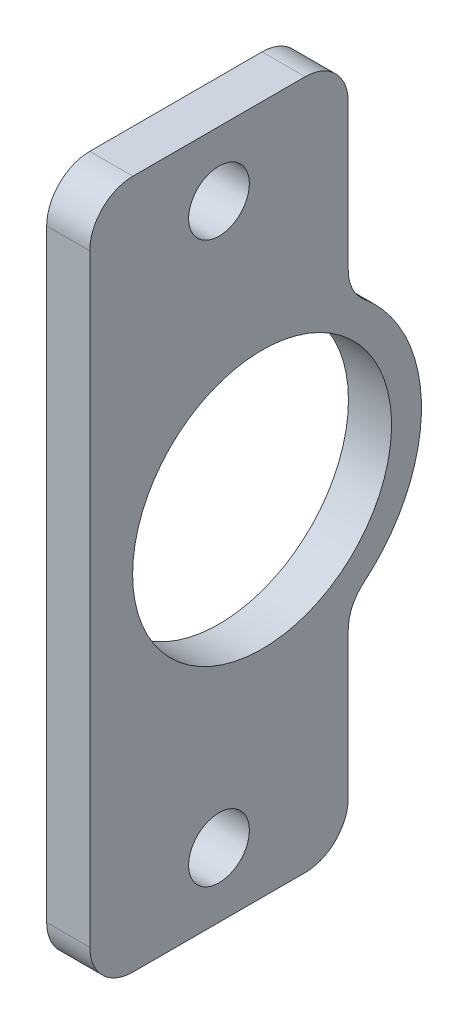
ISO-10303-21;
HEADER;
FILE_DESCRIPTION(('STEP AP214'),'2;1');
FILE_NAME('part.step','',(''),(''),'','','');
FILE_SCHEMA(('AUTOMOTIVE_DESIGN { 1 0 10303 214 1 1 1 1 }'));
ENDSEC;
DATA;
#1=APPLICATION_CONTEXT('core data for automotive mechanical design processes');
#2=APPLICATION_PROTOCOL_DEFINITION('international standard','automotive_design',2000,#1);
#3=PRODUCT_CONTEXT('',#1,'mechanical');
#4=PRODUCT('Part','Part','',(#3));
#5=PRODUCT_RELATED_PRODUCT_CATEGORY('part','',(#4));
#6=PRODUCT_DEFINITION_FORMATION('','',#4);
#7=PRODUCT_DEFINITION_CONTEXT('part definition',#1,'design');
#8=PRODUCT_DEFINITION('design','',#6,#7);
#9=PRODUCT_DEFINITION_SHAPE('','',#8);
#10=(LENGTH_UNIT() NAMED_UNIT(*) SI_UNIT(.MILLI.,.METRE.));
#11=(NAMED_UNIT(*) PLANE_ANGLE_UNIT() SI_UNIT($,.RADIAN.));
#12=(NAMED_UNIT(*) SI_UNIT($,.STERADIAN.) SOLID_ANGLE_UNIT());
#13=UNCERTAINTY_MEASURE_WITH_UNIT(LENGTH_MEASURE(1.E-05),#10,'distance_accuracy_value','');
#14=(GEOMETRIC_REPRESENTATION_CONTEXT(3) GLOBAL_UNCERTAINTY_ASSIGNED_CONTEXT((#13)) GLOBAL_UNIT_ASSIGNED_CONTEXT((#10,
#11,#12)) REPRESENTATION_CONTEXT('',''));
#15=CARTESIAN_POINT('',(0.,0.,0.));
#16=DIRECTION('',(0.,0.,1.));
#17=DIRECTION('',(1.,0.,0.));
#18=AXIS2_PLACEMENT_3D('',#15,#16,#17);
#19=CARTESIAN_POINT('',(34.9999999999999,0.,-1.74860126378462E-13));
#20=DIRECTION('',(-1.,0.,0.));
#21=DIRECTION('',(0.,0.,1.));
#22=AXIS2_PLACEMENT_3D('',#19,#20,#21);
#23=PLANE('',#22);
#24=CARTESIAN_POINT('',(34.9999999999999,0.,-10.));
#25=DIRECTION('',(-1.,0.,0.));
#26=DIRECTION('',(0.,0.,1.));
#27=AXIS2_PLACEMENT_3D('',#24,#25,#26);
#28=CIRCLE('',#27,30.05);
#29=CARTESIAN_POINT('',(34.9999999999999,0.,20.05));
#30=VERTEX_POINT('',#29);
#31=EDGE_CURVE('E207',#30,#30,#28,.T.);
#32=ORIENTED_EDGE('',*,*,#31,.T.);
#33=EDGE_LOOP('',(#32));
#34=FACE_BOUND('',#33,.T.);
#35=CARTESIAN_POINT('',(34.9999999999999,-65.,-1.78329573330415E-13));
#36=DIRECTION('',(1.,0.,0.));
#37=DIRECTION('',(0.,0.,-1.));
#38=AXIS2_PLACEMENT_3D('',#35,#36,#37);
#39=CIRCLE('',#38,7.05);
#40=CARTESIAN_POINT('',(34.9999999999999,-65.,-7.05000000000018));
#41=VERTEX_POINT('',#40);
#42=EDGE_CURVE('E216',#41,#41,#39,.T.);
#43=ORIENTED_EDGE('',*,*,#42,.F.);
#44=EDGE_LOOP('',(#43));
#45=FACE_BOUND('',#44,.T.);
#46=CARTESIAN_POINT('',(34.9999999999999,65.,-1.76697096577183E-13));
#47=DIRECTION('',(1.,0.,0.));
#48=DIRECTION('',(0.,0.,-1.));
#49=AXIS2_PLACEMENT_3D('',#46,#47,#48);
#50=CIRCLE('',#49,7.05);
#51=CARTESIAN_POINT('',(34.9999999999999,65.,-7.05000000000018));
#52=VERTEX_POINT('',#51);
#53=EDGE_CURVE('E212',#52,#52,#50,.T.);
#54=ORIENTED_EDGE('',*,*,#53,.F.);
#55=EDGE_LOOP('',(#54));
#56=FACE_BOUND('',#55,.T.);
#57=DIRECTION('',(0.,1.,0.));
#58=VECTOR('',#57,1.);
#59=CARTESIAN_POINT('',(34.9999999999999,-80.,-30.0000000000002));
#60=LINE('',#59,#58);
#61=CARTESIAN_POINT('',(34.9999999999999,36.180105030251,-30.0000000000002));
#62=VERTEX_POINT('',#61);
#63=CARTESIAN_POINT('',(34.9999999999999,70.,-30.0000000000002));
#64=VERTEX_POINT('',#63);
#65=EDGE_CURVE('E237',#62,#64,#60,.T.);
#66=ORIENTED_EDGE('',*,*,#65,.T.);
#67=CARTESIAN_POINT('',(34.9999999999999,70.,-20.0000000000002));
#68=DIRECTION('',(-1.,0.,0.));
#69=DIRECTION('',(0.,0.,1.));
#70=AXIS2_PLACEMENT_3D('',#67,#68,#69);
#71=CIRCLE('',#70,10.);
#72=CARTESIAN_POINT('',(34.9999999999999,80.,-20.0000000000002));
#73=VERTEX_POINT('',#72);
#74=EDGE_CURVE('E149',#64,#73,#71,.F.);
#75=ORIENTED_EDGE('',*,*,#74,.T.);
#76=DIRECTION('',(0.,0.,1.));
#77=VECTOR('',#76,1.);
#78=CARTESIAN_POINT('',(34.9999999999999,80.,-30.0000000000002));
#79=LINE('',#78,#77);
#80=CARTESIAN_POINT('',(34.9999999999999,80.,19.9999999999998));
#81=VERTEX_POINT('',#80);
#82=EDGE_CURVE('E144',#73,#81,#79,.T.);
#83=ORIENTED_EDGE('',*,*,#82,.T.);
#84=CARTESIAN_POINT('',(34.9999999999999,70.,19.9999999999998));
#85=DIRECTION('',(-1.,0.,0.));
#86=DIRECTION('',(0.,0.,1.));
#87=AXIS2_PLACEMENT_3D('',#84,#85,#86);
#88=CIRCLE('',#87,10.);
#89=CARTESIAN_POINT('',(34.9999999999999,70.,29.9999999999998));
#90=VERTEX_POINT('',#89);
#91=EDGE_CURVE('E127',#81,#90,#88,.F.);
#92=ORIENTED_EDGE('',*,*,#91,.T.);
#93=DIRECTION('',(0.,-1.,0.));
#94=VECTOR('',#93,1.);
#95=CARTESIAN_POINT('',(34.9999999999999,-80.0000000000001,29.9999999999998));
#96=LINE('',#95,#94);
#97=CARTESIAN_POINT('',(34.9999999999999,-70.0000000000001,29.9999999999998));
#98=VERTEX_POINT('',#97);
#99=EDGE_CURVE('E137',#90,#98,#96,.T.);
#100=ORIENTED_EDGE('',*,*,#99,.T.);
#101=CARTESIAN_POINT('',(34.9999999999999,-70.0000000000001,19.9999999999998));
#102=DIRECTION('',(-1.,0.,0.));
#103=DIRECTION('',(0.,0.,1.));
#104=AXIS2_PLACEMENT_3D('',#101,#102,#103);
#105=CIRCLE('',#104,10.);
#106=CARTESIAN_POINT('',(34.9999999999999,-80.0000000000001,19.9999999999998));
#107=VERTEX_POINT('',#106);
#108=EDGE_CURVE('E157',#98,#107,#105,.F.);
#109=ORIENTED_EDGE('',*,*,#108,.T.);
#110=DIRECTION('',(0.,0.,-1.));
#111=VECTOR('',#110,1.);
#112=CARTESIAN_POINT('',(34.9999999999999,-80.,-30.0000000000002));
#113=LINE('',#112,#111);
#114=CARTESIAN_POINT('',(34.9999999999999,-80.,-20.0000000000002));
#115=VERTEX_POINT('',#114);
#116=EDGE_CURVE('E222',#107,#115,#113,.T.);
#117=ORIENTED_EDGE('',*,*,#116,.T.);
#118=CARTESIAN_POINT('',(34.9999999999999,-70.,-20.0000000000002));
#119=DIRECTION('',(-1.,0.,0.));
#120=DIRECTION('',(0.,0.,1.));
#121=AXIS2_PLACEMENT_3D('',#118,#119,#120);
#122=CIRCLE('',#121,10.);
#123=CARTESIAN_POINT('',(34.9999999999999,-70.,-30.0000000000002));
#124=VERTEX_POINT('',#123);
#125=EDGE_CURVE('E151',#115,#124,#122,.F.);
#126=ORIENTED_EDGE('',*,*,#125,.T.);
#127=CARTESIAN_POINT('',(34.9999999999999,-36.180105030251,-30.0000000000002));
#128=VERTEX_POINT('',#127);
#129=EDGE_CURVE('E238',#124,#128,#60,.T.);
#130=ORIENTED_EDGE('',*,*,#129,.T.);
#131=CARTESIAN_POINT('',(34.9999999999999,-36.180105030251,-40.0000000000002));
#132=DIRECTION('',(1.,0.,0.));
#133=DIRECTION('',(0.,0.,-1.));
#134=AXIS2_PLACEMENT_3D('',#131,#132,#133);
#135=CIRCLE('',#134,10.);
#136=CARTESIAN_POINT('',(34.9999999999999,-28.4822103429636,-33.6170212765959));
#137=VERTEX_POINT('',#136);
#138=EDGE_CURVE('E192',#137,#128,#135,.T.);
#139=ORIENTED_EDGE('',*,*,#138,.F.);
#140=CARTESIAN_POINT('',(34.9999999999999,0.,-10.));
#141=DIRECTION('',(-1.,0.,0.));
#142=DIRECTION('',(0.,0.,1.));
#143=AXIS2_PLACEMENT_3D('',#140,#141,#142);
#144=CIRCLE('',#143,37.);
#145=CARTESIAN_POINT('',(34.9999999999999,28.4822103429635,-33.6170212765959));
#146=VERTEX_POINT('',#145);
#147=EDGE_CURVE('E201',#146,#137,#144,.T.);
#148=ORIENTED_EDGE('',*,*,#147,.F.);
#149=CARTESIAN_POINT('',(34.9999999999999,36.180105030251,-40.0000000000002));
#150=DIRECTION('',(1.,0.,0.));
#151=DIRECTION('',(0.,0.,-1.));
#152=AXIS2_PLACEMENT_3D('',#149,#150,#151);
#153=CIRCLE('',#152,10.);
#154=EDGE_CURVE('E44',#62,#146,#153,.T.);
#155=ORIENTED_EDGE('',*,*,#154,.F.);
#156=EDGE_LOOP('',(#66,#75,#83,#92,#100,#109,#117,#126,#130,#139,#148,#155));
#157=FACE_BOUND('',#156,.T.);
#158=ADVANCED_FACE('F36',(#34,#45,#56,#157),#23,.F.);
#159=CARTESIAN_POINT('',(24.9999999999999,-80.,-30.0000000000002));
#160=DIRECTION('',(0.,0.,-1.));
#161=DIRECTION('',(-1.,0.,0.));
#162=AXIS2_PLACEMENT_3D('',#159,#160,#161);
#163=PLANE('',#162);
#164=ORIENTED_EDGE('',*,*,#129,.F.);
#165=DIRECTION('',(1.,0.,0.));
#166=VECTOR('',#165,1.);
#167=CARTESIAN_POINT('',(24.9999999999999,-70.,-30.0000000000002));
#168=LINE('',#167,#166);
#169=CARTESIAN_POINT('',(24.9999999999999,-70.,-30.0000000000002));
#170=VERTEX_POINT('',#169);
#171=EDGE_CURVE('E173',#124,#170,#168,.F.);
#172=ORIENTED_EDGE('',*,*,#171,.T.);
#173=DIRECTION('',(0.,1.,0.));
#174=VECTOR('',#173,1.);
#175=CARTESIAN_POINT('',(24.9999999999999,-80.,-30.0000000000002));
#176=LINE('',#175,#174);
#177=CARTESIAN_POINT('',(24.9999999999999,-36.180105030251,-30.0000000000002));
#178=VERTEX_POINT('',#177);
#179=EDGE_CURVE('E228',#170,#178,#176,.T.);
#180=ORIENTED_EDGE('',*,*,#179,.T.);
#181=DIRECTION('',(-1.,0.,0.));
#182=VECTOR('',#181,1.);
#183=CARTESIAN_POINT('',(24.9999999999999,-36.180105030251,-30.0000000000002));
#184=LINE('',#183,#182);
#185=EDGE_CURVE('E188',#128,#178,#184,.T.);
#186=ORIENTED_EDGE('',*,*,#185,.F.);
#187=EDGE_LOOP('',(#164,#172,#180,#186));
#188=FACE_BOUND('',#187,.T.);
#189=ADVANCED_FACE('F267',(#188),#163,.T.);
#190=CARTESIAN_POINT('',(24.9999999999999,-80.,-30.0000000000002));
#191=DIRECTION('',(0.,-1.,0.));
#192=DIRECTION('',(0.,0.,-1.));
#193=AXIS2_PLACEMENT_3D('',#190,#191,#192);
#194=PLANE('',#193);
#195=ORIENTED_EDGE('',*,*,#116,.F.);
#196=DIRECTION('',(1.,0.,0.));
#197=VECTOR('',#196,1.);
#198=CARTESIAN_POINT('',(24.9999999999999,-80.0000000000001,19.9999999999998));
#199=LINE('',#198,#197);
#200=CARTESIAN_POINT('',(24.9999999999999,-80.0000000000001,19.9999999999998));
#201=VERTEX_POINT('',#200);
#202=EDGE_CURVE('E161',#107,#201,#199,.F.);
#203=ORIENTED_EDGE('',*,*,#202,.T.);
#204=DIRECTION('',(0.,0.,-1.));
#205=VECTOR('',#204,1.);
#206=CARTESIAN_POINT('',(24.9999999999999,-80.,-30.0000000000002));
#207=LINE('',#206,#205);
#208=CARTESIAN_POINT('',(24.9999999999999,-80.,-20.0000000000002));
#209=VERTEX_POINT('',#208);
#210=EDGE_CURVE('E143',#201,#209,#207,.T.);
#211=ORIENTED_EDGE('',*,*,#210,.T.);
#212=DIRECTION('',(1.,0.,0.));
#213=VECTOR('',#212,1.);
#214=CARTESIAN_POINT('',(24.9999999999999,-80.,-20.0000000000002));
#215=LINE('',#214,#213);
#216=EDGE_CURVE('E159',#209,#115,#215,.T.);
#217=ORIENTED_EDGE('',*,*,#216,.T.);
#218=EDGE_LOOP('',(#195,#203,#211,#217));
#219=FACE_BOUND('',#218,.T.);
#220=ADVANCED_FACE('F261',(#219),#194,.T.);
#221=CARTESIAN_POINT('',(24.9999999999999,-80.0000000000001,29.9999999999998));
#222=DIRECTION('',(0.,0.,1.));
#223=DIRECTION('',(1.,0.,0.));
#224=AXIS2_PLACEMENT_3D('',#221,#222,#223);
#225=PLANE('',#224);
#226=DIRECTION('',(0.,-1.,0.));
#227=VECTOR('',#226,1.);
#228=CARTESIAN_POINT('',(24.9999999999999,-80.0000000000001,29.9999999999998));
#229=LINE('',#228,#227);
#230=CARTESIAN_POINT('',(24.9999999999999,70.,29.9999999999998));
#231=VERTEX_POINT('',#230);
#232=CARTESIAN_POINT('',(24.9999999999999,-70.0000000000001,29.9999999999998));
#233=VERTEX_POINT('',#232);
#234=EDGE_CURVE('E134',#231,#233,#229,.T.);
#235=ORIENTED_EDGE('',*,*,#234,.T.);
#236=DIRECTION('',(1.,0.,0.));
#237=VECTOR('',#236,1.);
#238=CARTESIAN_POINT('',(24.9999999999999,-70.0000000000001,29.9999999999998));
#239=LINE('',#238,#237);
#240=EDGE_CURVE('E133',#233,#98,#239,.T.);
#241=ORIENTED_EDGE('',*,*,#240,.T.);
#242=ORIENTED_EDGE('',*,*,#99,.F.);
#243=DIRECTION('',(1.,0.,0.));
#244=VECTOR('',#243,1.);
#245=CARTESIAN_POINT('',(24.9999999999999,70.,29.9999999999998));
#246=LINE('',#245,#244);
#247=EDGE_CURVE('E122',#90,#231,#246,.F.);
#248=ORIENTED_EDGE('',*,*,#247,.T.);
#249=EDGE_LOOP('',(#235,#241,#242,#248));
#250=FACE_BOUND('',#249,.T.);
#251=ADVANCED_FACE('F138',(#250),#225,.T.);
#252=CARTESIAN_POINT('',(24.9999999999999,80.,-30.0000000000002));
#253=DIRECTION('',(0.,1.,0.));
#254=DIRECTION('',(0.,0.,1.));
#255=AXIS2_PLACEMENT_3D('',#252,#253,#254);
#256=PLANE('',#255);
#257=ORIENTED_EDGE('',*,*,#82,.F.);
#258=DIRECTION('',(1.,0.,0.));
#259=VECTOR('',#258,1.);
#260=CARTESIAN_POINT('',(24.9999999999999,80.,-20.0000000000002));
#261=LINE('',#260,#259);
#262=CARTESIAN_POINT('',(24.9999999999999,80.,-20.0000000000002));
#263=VERTEX_POINT('',#262);
#264=EDGE_CURVE('E178',#73,#263,#261,.F.);
#265=ORIENTED_EDGE('',*,*,#264,.T.);
#266=DIRECTION('',(0.,0.,1.));
#267=VECTOR('',#266,1.);
#268=CARTESIAN_POINT('',(24.9999999999999,80.,-30.0000000000002));
#269=LINE('',#268,#267);
#270=CARTESIAN_POINT('',(24.9999999999999,80.,19.9999999999998));
#271=VERTEX_POINT('',#270);
#272=EDGE_CURVE('E231',#263,#271,#269,.T.);
#273=ORIENTED_EDGE('',*,*,#272,.T.);
#274=DIRECTION('',(1.,0.,0.));
#275=VECTOR('',#274,1.);
#276=CARTESIAN_POINT('',(24.9999999999999,80.,19.9999999999998));
#277=LINE('',#276,#275);
#278=EDGE_CURVE('E176',#271,#81,#277,.T.);
#279=ORIENTED_EDGE('',*,*,#278,.T.);
#280=EDGE_LOOP('',(#257,#265,#273,#279));
#281=FACE_BOUND('',#280,.T.);
#282=ADVANCED_FACE('F251',(#281),#256,.T.);
#283=CARTESIAN_POINT('',(24.9999999999999,36.180105030251,-30.0000000000002));
#284=VERTEX_POINT('',#283);
#285=CARTESIAN_POINT('',(24.9999999999999,70.,-30.0000000000002));
#286=VERTEX_POINT('',#285);
#287=EDGE_CURVE('E227',#284,#286,#176,.T.);
#288=ORIENTED_EDGE('',*,*,#287,.T.);
#289=DIRECTION('',(1.,0.,0.));
#290=VECTOR('',#289,1.);
#291=CARTESIAN_POINT('',(24.9999999999999,70.,-30.0000000000002));
#292=LINE('',#291,#290);
#293=EDGE_CURVE('E171',#286,#64,#292,.T.);
#294=ORIENTED_EDGE('',*,*,#293,.T.);
#295=ORIENTED_EDGE('',*,*,#65,.F.);
#296=DIRECTION('',(-1.,0.,0.));
#297=VECTOR('',#296,1.);
#298=CARTESIAN_POINT('',(34.9999999999999,36.180105030251,-30.0000000000002));
#299=LINE('',#298,#297);
#300=EDGE_CURVE('E53',#284,#62,#299,.F.);
#301=ORIENTED_EDGE('',*,*,#300,.F.);
#302=EDGE_LOOP('',(#288,#294,#295,#301));
#303=FACE_BOUND('',#302,.T.);
#304=ADVANCED_FACE('F244',(#303),#163,.T.);
#305=CARTESIAN_POINT('',(24.9999999999999,0.,-1.74860126378462E-13));
#306=DIRECTION('',(-1.,0.,0.));
#307=DIRECTION('',(0.,0.,1.));
#308=AXIS2_PLACEMENT_3D('',#305,#306,#307);
#309=PLANE('',#308);
#310=CARTESIAN_POINT('',(24.9999999999999,0.,-10.));
#311=DIRECTION('',(-1.,0.,0.));
#312=DIRECTION('',(0.,0.,1.));
#313=AXIS2_PLACEMENT_3D('',#310,#311,#312);
#314=CIRCLE('',#313,37.);
#315=CARTESIAN_POINT('',(24.9999999999999,28.4822103429635,-33.6170212765959));
#316=VERTEX_POINT('',#315);
#317=CARTESIAN_POINT('',(24.9999999999999,-28.4822103429636,-33.6170212765959));
#318=VERTEX_POINT('',#317);
#319=EDGE_CURVE('E204',#316,#318,#314,.T.);
#320=ORIENTED_EDGE('',*,*,#319,.T.);
#321=CARTESIAN_POINT('',(24.9999999999999,-36.180105030251,-40.0000000000002));
#322=DIRECTION('',(1.,0.,0.));
#323=DIRECTION('',(0.,0.,-1.));
#324=AXIS2_PLACEMENT_3D('',#321,#322,#323);
#325=CIRCLE('',#324,10.);
#326=EDGE_CURVE('E195',#178,#318,#325,.F.);
#327=ORIENTED_EDGE('',*,*,#326,.F.);
#328=ORIENTED_EDGE('',*,*,#179,.F.);
#329=CARTESIAN_POINT('',(24.9999999999999,-70.,-20.0000000000002));
#330=DIRECTION('',(-1.,0.,0.));
#331=DIRECTION('',(0.,0.,1.));
#332=AXIS2_PLACEMENT_3D('',#329,#330,#331);
#333=CIRCLE('',#332,10.);
#334=EDGE_CURVE('E167',#170,#209,#333,.T.);
#335=ORIENTED_EDGE('',*,*,#334,.T.);
#336=ORIENTED_EDGE('',*,*,#210,.F.);
#337=CARTESIAN_POINT('',(24.9999999999999,-70.0000000000001,19.9999999999998));
#338=DIRECTION('',(-1.,0.,0.));
#339=DIRECTION('',(0.,0.,1.));
#340=AXIS2_PLACEMENT_3D('',#337,#338,#339);
#341=CIRCLE('',#340,10.);
#342=EDGE_CURVE('E169',#201,#233,#341,.T.);
#343=ORIENTED_EDGE('',*,*,#342,.T.);
#344=ORIENTED_EDGE('',*,*,#234,.F.);
#345=CARTESIAN_POINT('',(24.9999999999999,70.,19.9999999999998));
#346=DIRECTION('',(-1.,0.,0.));
#347=DIRECTION('',(0.,0.,1.));
#348=AXIS2_PLACEMENT_3D('',#345,#346,#347);
#349=CIRCLE('',#348,10.);
#350=EDGE_CURVE('E129',#231,#271,#349,.T.);
#351=ORIENTED_EDGE('',*,*,#350,.T.);
#352=ORIENTED_EDGE('',*,*,#272,.F.);
#353=CARTESIAN_POINT('',(24.9999999999999,70.,-20.0000000000002));
#354=DIRECTION('',(-1.,0.,0.));
#355=DIRECTION('',(0.,0.,1.));
#356=AXIS2_PLACEMENT_3D('',#353,#354,#355);
#357=CIRCLE('',#356,10.);
#358=EDGE_CURVE('E165',#263,#286,#357,.T.);
#359=ORIENTED_EDGE('',*,*,#358,.T.);
#360=ORIENTED_EDGE('',*,*,#287,.F.);
#361=CARTESIAN_POINT('',(24.9999999999999,36.180105030251,-40.0000000000002));
#362=DIRECTION('',(1.,0.,0.));
#363=DIRECTION('',(0.,0.,-1.));
#364=AXIS2_PLACEMENT_3D('',#361,#362,#363);
#365=CIRCLE('',#364,10.);
#366=EDGE_CURVE('E11',#316,#284,#365,.F.);
#367=ORIENTED_EDGE('',*,*,#366,.F.);
#368=EDGE_LOOP('',(#320,#327,#328,#335,#336,#343,#344,#351,#352,#359,#360,#367));
#369=FACE_BOUND('',#368,.T.);
#370=CARTESIAN_POINT('',(24.9999999999999,0.,-10.));
#371=DIRECTION('',(1.,0.,0.));
#372=DIRECTION('',(0.,0.,-1.));
#373=AXIS2_PLACEMENT_3D('',#370,#371,#372);
#374=CIRCLE('',#373,30.05);
#375=CARTESIAN_POINT('',(24.9999999999999,0.,-40.05));
#376=VERTEX_POINT('',#375);
#377=EDGE_CURVE('E181',#376,#376,#374,.T.);
#378=ORIENTED_EDGE('',*,*,#377,.T.);
#379=EDGE_LOOP('',(#378));
#380=FACE_BOUND('',#379,.T.);
#381=CARTESIAN_POINT('',(24.9999999999999,65.,-1.76697096577183E-13));
#382=DIRECTION('',(1.,0.,0.));
#383=DIRECTION('',(0.,0.,-1.));
#384=AXIS2_PLACEMENT_3D('',#381,#382,#383);
#385=CIRCLE('',#384,7.05);
#386=CARTESIAN_POINT('',(24.9999999999999,65.,-7.05000000000018));
#387=VERTEX_POINT('',#386);
#388=EDGE_CURVE('E213',#387,#387,#385,.T.);
#389=ORIENTED_EDGE('',*,*,#388,.T.);
#390=EDGE_LOOP('',(#389));
#391=FACE_BOUND('',#390,.T.);
#392=CARTESIAN_POINT('',(24.9999999999999,-65.,-1.78329573330415E-13));
#393=DIRECTION('',(1.,0.,0.));
#394=DIRECTION('',(0.,0.,-1.));
#395=AXIS2_PLACEMENT_3D('',#392,#393,#394);
#396=CIRCLE('',#395,7.05);
#397=CARTESIAN_POINT('',(24.9999999999999,-65.,-7.05000000000018));
#398=VERTEX_POINT('',#397);
#399=EDGE_CURVE('E219',#398,#398,#396,.T.);
#400=ORIENTED_EDGE('',*,*,#399,.T.);
#401=EDGE_LOOP('',(#400));
#402=FACE_BOUND('',#401,.T.);
#403=ADVANCED_FACE('F253',(#369,#380,#391,#402),#309,.T.);
#404=CARTESIAN_POINT('',(24.9999999999999,-65.,-1.78329573330415E-13));
#405=DIRECTION('',(1.,0.,0.));
#406=DIRECTION('',(0.,0.,-1.));
#407=AXIS2_PLACEMENT_3D('',#404,#405,#406);
#408=CYLINDRICAL_SURFACE('',#407,7.05);
#409=ORIENTED_EDGE('',*,*,#399,.F.);
#410=EDGE_LOOP('',(#409));
#411=FACE_BOUND('',#410,.T.);
#412=ORIENTED_EDGE('',*,*,#42,.T.);
#413=EDGE_LOOP('',(#412));
#414=FACE_BOUND('',#413,.T.);
#415=ADVANCED_FACE('F346',(#411,#414),#408,.F.);
#416=CARTESIAN_POINT('',(24.9999999999999,65.,-1.76697096577183E-13));
#417=DIRECTION('',(1.,0.,0.));
#418=DIRECTION('',(0.,0.,-1.));
#419=AXIS2_PLACEMENT_3D('',#416,#417,#418);
#420=CYLINDRICAL_SURFACE('',#419,7.05);
#421=ORIENTED_EDGE('',*,*,#388,.F.);
#422=EDGE_LOOP('',(#421));
#423=FACE_BOUND('',#422,.T.);
#424=ORIENTED_EDGE('',*,*,#53,.T.);
#425=EDGE_LOOP('',(#424));
#426=FACE_BOUND('',#425,.T.);
#427=ADVANCED_FACE('F301',(#423,#426),#420,.F.);
#428=CARTESIAN_POINT('',(24.9999999999999,-70.0000000000001,19.9999999999998));
#429=DIRECTION('',(1.,0.,0.));
#430=DIRECTION('',(0.,0.,-1.));
#431=AXIS2_PLACEMENT_3D('',#428,#429,#430);
#432=CYLINDRICAL_SURFACE('',#431,10.);
#433=ORIENTED_EDGE('',*,*,#342,.F.);
#434=ORIENTED_EDGE('',*,*,#202,.F.);
#435=ORIENTED_EDGE('',*,*,#108,.F.);
#436=ORIENTED_EDGE('',*,*,#240,.F.);
#437=EDGE_LOOP('',(#433,#434,#435,#436));
#438=FACE_BOUND('',#437,.T.);
#439=ADVANCED_FACE('F257',(#438),#432,.T.);
#440=CARTESIAN_POINT('',(24.9999999999999,-70.,-20.0000000000002));
#441=DIRECTION('',(1.,0.,0.));
#442=DIRECTION('',(0.,0.,-1.));
#443=AXIS2_PLACEMENT_3D('',#440,#441,#442);
#444=CYLINDRICAL_SURFACE('',#443,10.);
#445=ORIENTED_EDGE('',*,*,#334,.F.);
#446=ORIENTED_EDGE('',*,*,#171,.F.);
#447=ORIENTED_EDGE('',*,*,#125,.F.);
#448=ORIENTED_EDGE('',*,*,#216,.F.);
#449=EDGE_LOOP('',(#445,#446,#447,#448));
#450=FACE_BOUND('',#449,.T.);
#451=ADVANCED_FACE('F264',(#450),#444,.T.);
#452=CARTESIAN_POINT('',(24.9999999999999,70.,-20.0000000000002));
#453=DIRECTION('',(1.,0.,0.));
#454=DIRECTION('',(0.,0.,-1.));
#455=AXIS2_PLACEMENT_3D('',#452,#453,#454);
#456=CYLINDRICAL_SURFACE('',#455,10.);
#457=ORIENTED_EDGE('',*,*,#358,.F.);
#458=ORIENTED_EDGE('',*,*,#264,.F.);
#459=ORIENTED_EDGE('',*,*,#74,.F.);
#460=ORIENTED_EDGE('',*,*,#293,.F.);
#461=EDGE_LOOP('',(#457,#458,#459,#460));
#462=FACE_BOUND('',#461,.T.);
#463=ADVANCED_FACE('F248',(#462),#456,.T.);
#464=CARTESIAN_POINT('',(24.9999999999999,70.,19.9999999999998));
#465=DIRECTION('',(1.,0.,0.));
#466=DIRECTION('',(0.,0.,-1.));
#467=AXIS2_PLACEMENT_3D('',#464,#465,#466);
#468=CYLINDRICAL_SURFACE('',#467,10.);
#469=ORIENTED_EDGE('',*,*,#350,.F.);
#470=ORIENTED_EDGE('',*,*,#247,.F.);
#471=ORIENTED_EDGE('',*,*,#91,.F.);
#472=ORIENTED_EDGE('',*,*,#278,.F.);
#473=EDGE_LOOP('',(#469,#470,#471,#472));
#474=FACE_BOUND('',#473,.T.);
#475=ADVANCED_FACE('F124',(#474),#468,.T.);
#476=CARTESIAN_POINT('',(34.9999999999999,0.,-10.));
#477=DIRECTION('',(1.,0.,0.));
#478=DIRECTION('',(0.,0.,1.));
#479=AXIS2_PLACEMENT_3D('',#476,#477,#478);
#480=CYLINDRICAL_SURFACE('',#479,30.05);
#481=ORIENTED_EDGE('',*,*,#377,.F.);
#482=EDGE_LOOP('',(#481));
#483=FACE_BOUND('',#482,.T.);
#484=ORIENTED_EDGE('',*,*,#31,.F.);
#485=EDGE_LOOP('',(#484));
#486=FACE_BOUND('',#485,.T.);
#487=ADVANCED_FACE('F273',(#483,#486),#480,.F.);
#488=CARTESIAN_POINT('',(24.9999999999999,0.,-10.));
#489=DIRECTION('',(1.,0.,0.));
#490=DIRECTION('',(0.,0.,1.));
#491=AXIS2_PLACEMENT_3D('',#488,#489,#490);
#492=CYLINDRICAL_SURFACE('',#491,37.);
#493=ORIENTED_EDGE('',*,*,#319,.F.);
#494=DIRECTION('',(1.,0.,0.));
#495=VECTOR('',#494,1.);
#496=CARTESIAN_POINT('',(24.9999999999999,28.4822103429635,-33.6170212765959));
#497=LINE('',#496,#495);
#498=EDGE_CURVE('E184',#146,#316,#497,.F.);
#499=ORIENTED_EDGE('',*,*,#498,.F.);
#500=ORIENTED_EDGE('',*,*,#147,.T.);
#501=DIRECTION('',(1.,0.,0.));
#502=VECTOR('',#501,1.);
#503=CARTESIAN_POINT('',(24.9999999999999,-28.4822103429636,-33.6170212765959));
#504=LINE('',#503,#502);
#505=EDGE_CURVE('E186',#318,#137,#504,.T.);
#506=ORIENTED_EDGE('',*,*,#505,.F.);
#507=EDGE_LOOP('',(#493,#499,#500,#506));
#508=FACE_BOUND('',#507,.T.);
#509=ADVANCED_FACE('F271',(#508),#492,.T.);
#510=CARTESIAN_POINT('',(24.9999999999999,-36.180105030251,-40.0000000000002));
#511=DIRECTION('',(1.,0.,0.));
#512=DIRECTION('',(0.,0.,1.));
#513=AXIS2_PLACEMENT_3D('',#510,#511,#512);
#514=CYLINDRICAL_SURFACE('',#513,10.);
#515=ORIENTED_EDGE('',*,*,#326,.T.);
#516=ORIENTED_EDGE('',*,*,#505,.T.);
#517=ORIENTED_EDGE('',*,*,#138,.T.);
#518=ORIENTED_EDGE('',*,*,#185,.T.);
#519=EDGE_LOOP('',(#515,#516,#517,#518));
#520=FACE_BOUND('',#519,.T.);
#521=ADVANCED_FACE('F269',(#520),#514,.F.);
#522=CARTESIAN_POINT('',(24.9999999999999,36.180105030251,-40.0000000000002));
#523=DIRECTION('',(1.,0.,0.));
#524=DIRECTION('',(0.,0.,1.));
#525=AXIS2_PLACEMENT_3D('',#522,#523,#524);
#526=CYLINDRICAL_SURFACE('',#525,10.);
#527=ORIENTED_EDGE('',*,*,#366,.T.);
#528=ORIENTED_EDGE('',*,*,#300,.T.);
#529=ORIENTED_EDGE('',*,*,#154,.T.);
#530=ORIENTED_EDGE('',*,*,#498,.T.);
#531=EDGE_LOOP('',(#527,#528,#529,#530));
#532=FACE_BOUND('',#531,.T.);
#533=ADVANCED_FACE('F38',(#532),#526,.F.);
#534=CLOSED_SHELL('',(#158,#189,#220,#251,#282,#304,#403,#415,#427,#439,#451,#463,#475,#487,
#509,#521,#533));
#535=MANIFOLD_SOLID_BREP('B2',#534);
#536=ADVANCED_BREP_SHAPE_REPRESENTATION('',(#18,#535),#14);
#537=SHAPE_DEFINITION_REPRESENTATION(#9,#536);
ENDSEC;
END-ISO-10303-21;
